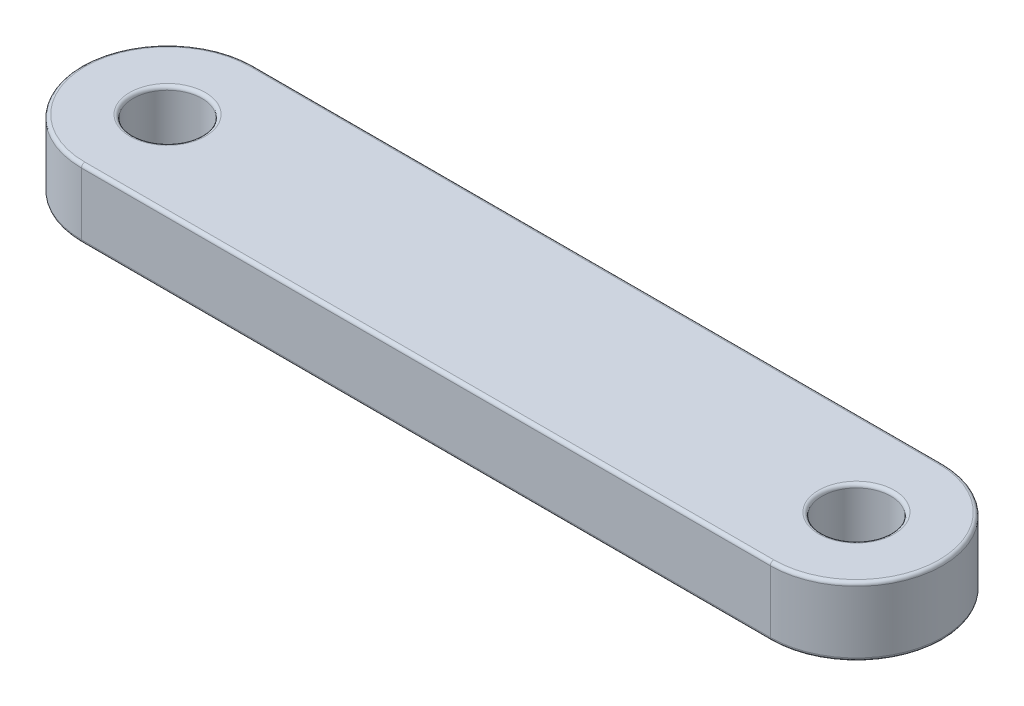
ISO-10303-21;
HEADER;
FILE_DESCRIPTION(('STEP AP214'),'2;1');
FILE_NAME('part.step','',(''),(''),'','','');
FILE_SCHEMA(('AUTOMOTIVE_DESIGN { 1 0 10303 214 1 1 1 1 }'));
ENDSEC;
DATA;
#1=APPLICATION_CONTEXT('core data for automotive mechanical design processes');
#2=APPLICATION_PROTOCOL_DEFINITION('international standard','automotive_design',2000,#1);
#3=PRODUCT_CONTEXT('',#1,'mechanical');
#4=PRODUCT('Part','Part','',(#3));
#5=PRODUCT_RELATED_PRODUCT_CATEGORY('part','',(#4));
#6=PRODUCT_DEFINITION_FORMATION('','',#4);
#7=PRODUCT_DEFINITION_CONTEXT('part definition',#1,'design');
#8=PRODUCT_DEFINITION('design','',#6,#7);
#9=PRODUCT_DEFINITION_SHAPE('','',#8);
#10=(LENGTH_UNIT() NAMED_UNIT(*) SI_UNIT(.MILLI.,.METRE.));
#11=(NAMED_UNIT(*) PLANE_ANGLE_UNIT() SI_UNIT($,.RADIAN.));
#12=(NAMED_UNIT(*) SI_UNIT($,.STERADIAN.) SOLID_ANGLE_UNIT());
#13=UNCERTAINTY_MEASURE_WITH_UNIT(LENGTH_MEASURE(1.E-05),#10,'distance_accuracy_value','');
#14=(GEOMETRIC_REPRESENTATION_CONTEXT(3) GLOBAL_UNCERTAINTY_ASSIGNED_CONTEXT((#13)) GLOBAL_UNIT_ASSIGNED_CONTEXT((#10,
#11,#12)) REPRESENTATION_CONTEXT('',''));
#15=CARTESIAN_POINT('',(0.,0.,0.));
#16=DIRECTION('',(0.,0.,1.));
#17=DIRECTION('',(1.,0.,0.));
#18=AXIS2_PLACEMENT_3D('',#15,#16,#17);
#19=CARTESIAN_POINT('',(-100.,20.,0.));
#20=DIRECTION('',(0.,1.,0.));
#21=DIRECTION('',(0.,0.,1.));
#22=AXIS2_PLACEMENT_3D('',#19,#20,#21);
#23=PLANE('',#22);
#24=CARTESIAN_POINT('',(100.,20.,0.));
#25=DIRECTION('',(0.,1.,0.));
#26=DIRECTION('',(0.,0.,1.));
#27=AXIS2_PLACEMENT_3D('',#24,#25,#26);
#28=CIRCLE('',#27,11.);
#29=CARTESIAN_POINT('',(100.,20.,11.));
#30=VERTEX_POINT('',#29);
#31=EDGE_CURVE('E11',#30,#30,#28,.F.);
#32=ORIENTED_EDGE('',*,*,#31,.T.);
#33=EDGE_LOOP('',(#32));
#34=FACE_BOUND('',#33,.T.);
#35=CARTESIAN_POINT('',(100.,20.,0.));
#36=DIRECTION('',(0.,1.,0.));
#37=DIRECTION('',(0.,0.,1.));
#38=AXIS2_PLACEMENT_3D('',#35,#36,#37);
#39=CIRCLE('',#38,24.);
#40=CARTESIAN_POINT('',(100.,20.,24.));
#41=VERTEX_POINT('',#40);
#42=CARTESIAN_POINT('',(100.,20.,-24.));
#43=VERTEX_POINT('',#42);
#44=EDGE_CURVE('E49',#41,#43,#39,.T.);
#45=ORIENTED_EDGE('',*,*,#44,.T.);
#46=DIRECTION('',(-1.,0.,0.));
#47=VECTOR('',#46,1.);
#48=CARTESIAN_POINT('',(-100.,20.,-24.));
#49=LINE('',#48,#47);
#50=CARTESIAN_POINT('',(-100.,20.,-24.));
#51=VERTEX_POINT('',#50);
#52=EDGE_CURVE('E41',#43,#51,#49,.T.);
#53=ORIENTED_EDGE('',*,*,#52,.T.);
#54=CARTESIAN_POINT('',(-100.,20.,0.));
#55=DIRECTION('',(0.,1.,0.));
#56=DIRECTION('',(0.,0.,1.));
#57=AXIS2_PLACEMENT_3D('',#54,#55,#56);
#58=CIRCLE('',#57,24.);
#59=CARTESIAN_POINT('',(-100.,20.,24.));
#60=VERTEX_POINT('',#59);
#61=EDGE_CURVE('E167',#51,#60,#58,.T.);
#62=ORIENTED_EDGE('',*,*,#61,.T.);
#63=DIRECTION('',(1.,0.,0.));
#64=VECTOR('',#63,1.);
#65=CARTESIAN_POINT('',(100.,20.,24.));
#66=LINE('',#65,#64);
#67=EDGE_CURVE('E54',#60,#41,#66,.T.);
#68=ORIENTED_EDGE('',*,*,#67,.T.);
#69=EDGE_LOOP('',(#45,#53,#62,#68));
#70=FACE_BOUND('',#69,.T.);
#71=CARTESIAN_POINT('',(-100.,20.,0.));
#72=DIRECTION('',(0.,1.,0.));
#73=DIRECTION('',(0.,0.,1.));
#74=AXIS2_PLACEMENT_3D('',#71,#72,#73);
#75=CIRCLE('',#74,11.);
#76=CARTESIAN_POINT('',(-100.,20.,11.));
#77=VERTEX_POINT('',#76);
#78=EDGE_CURVE('E164',#77,#77,#75,.F.);
#79=ORIENTED_EDGE('',*,*,#78,.T.);
#80=EDGE_LOOP('',(#79));
#81=FACE_BOUND('',#80,.T.);
#82=ADVANCED_FACE('F32',(#34,#70,#81),#23,.T.);
#83=CARTESIAN_POINT('',(-100.,0.,0.));
#84=DIRECTION('',(0.,1.,0.));
#85=DIRECTION('',(0.,0.,1.));
#86=AXIS2_PLACEMENT_3D('',#83,#84,#85);
#87=PLANE('',#86);
#88=CARTESIAN_POINT('',(100.,0.,0.));
#89=DIRECTION('',(0.,1.,0.));
#90=DIRECTION('',(0.,0.,1.));
#91=AXIS2_PLACEMENT_3D('',#88,#89,#90);
#92=CIRCLE('',#91,11.);
#93=CARTESIAN_POINT('',(100.,0.,11.));
#94=VERTEX_POINT('',#93);
#95=EDGE_CURVE('E129',#94,#94,#92,.T.);
#96=ORIENTED_EDGE('',*,*,#95,.T.);
#97=EDGE_LOOP('',(#96));
#98=FACE_BOUND('',#97,.T.);
#99=CARTESIAN_POINT('',(-100.,0.,0.));
#100=DIRECTION('',(0.,1.,0.));
#101=DIRECTION('',(0.,0.,1.));
#102=AXIS2_PLACEMENT_3D('',#99,#100,#101);
#103=CIRCLE('',#102,11.);
#104=CARTESIAN_POINT('',(-100.,0.,11.));
#105=VERTEX_POINT('',#104);
#106=EDGE_CURVE('E126',#105,#105,#103,.T.);
#107=ORIENTED_EDGE('',*,*,#106,.T.);
#108=EDGE_LOOP('',(#107));
#109=FACE_BOUND('',#108,.T.);
#110=CARTESIAN_POINT('',(100.,0.,0.));
#111=DIRECTION('',(0.,1.,0.));
#112=DIRECTION('',(0.,0.,1.));
#113=AXIS2_PLACEMENT_3D('',#110,#111,#112);
#114=CIRCLE('',#113,24.);
#115=CARTESIAN_POINT('',(100.,0.,-24.));
#116=VERTEX_POINT('',#115);
#117=CARTESIAN_POINT('',(100.,0.,24.));
#118=VERTEX_POINT('',#117);
#119=EDGE_CURVE('E125',#116,#118,#114,.F.);
#120=ORIENTED_EDGE('',*,*,#119,.T.);
#121=DIRECTION('',(1.,0.,0.));
#122=VECTOR('',#121,1.);
#123=CARTESIAN_POINT('',(-100.,0.,24.));
#124=LINE('',#123,#122);
#125=CARTESIAN_POINT('',(-100.,0.,24.));
#126=VERTEX_POINT('',#125);
#127=EDGE_CURVE('E104',#118,#126,#124,.F.);
#128=ORIENTED_EDGE('',*,*,#127,.T.);
#129=CARTESIAN_POINT('',(-100.,0.,0.));
#130=DIRECTION('',(0.,1.,0.));
#131=DIRECTION('',(0.,0.,1.));
#132=AXIS2_PLACEMENT_3D('',#129,#130,#131);
#133=CIRCLE('',#132,24.);
#134=CARTESIAN_POINT('',(-100.,0.,-24.));
#135=VERTEX_POINT('',#134);
#136=EDGE_CURVE('E114',#126,#135,#133,.F.);
#137=ORIENTED_EDGE('',*,*,#136,.T.);
#138=DIRECTION('',(-1.,0.,0.));
#139=VECTOR('',#138,1.);
#140=CARTESIAN_POINT('',(-100.,0.,-24.));
#141=LINE('',#140,#139);
#142=EDGE_CURVE('E120',#135,#116,#141,.F.);
#143=ORIENTED_EDGE('',*,*,#142,.T.);
#144=EDGE_LOOP('',(#120,#128,#137,#143));
#145=FACE_BOUND('',#144,.T.);
#146=ADVANCED_FACE('F123',(#98,#109,#145),#87,.F.);
#147=CARTESIAN_POINT('',(-100.,20.,0.));
#148=DIRECTION('',(0.,-1.,0.));
#149=DIRECTION('',(0.,0.,-1.));
#150=AXIS2_PLACEMENT_3D('',#147,#148,#149);
#151=CYLINDRICAL_SURFACE('',#150,25.);
#152=DIRECTION('',(0.,-1.,0.));
#153=VECTOR('',#152,1.);
#154=CARTESIAN_POINT('',(-100.,20.,-25.));
#155=LINE('',#154,#153);
#156=CARTESIAN_POINT('',(-100.,19.,-25.));
#157=VERTEX_POINT('',#156);
#158=CARTESIAN_POINT('',(-100.,1.,-25.));
#159=VERTEX_POINT('',#158);
#160=EDGE_CURVE('E176',#157,#159,#155,.T.);
#161=ORIENTED_EDGE('',*,*,#160,.T.);
#162=CARTESIAN_POINT('',(-100.,1.,0.));
#163=DIRECTION('',(0.,1.,0.));
#164=DIRECTION('',(0.,0.,1.));
#165=AXIS2_PLACEMENT_3D('',#162,#163,#164);
#166=CIRCLE('',#165,25.);
#167=CARTESIAN_POINT('',(-100.,1.,25.));
#168=VERTEX_POINT('',#167);
#169=EDGE_CURVE('E162',#159,#168,#166,.T.);
#170=ORIENTED_EDGE('',*,*,#169,.T.);
#171=DIRECTION('',(0.,-1.,0.));
#172=VECTOR('',#171,1.);
#173=CARTESIAN_POINT('',(-100.,20.,25.));
#174=LINE('',#173,#172);
#175=CARTESIAN_POINT('',(-100.,19.,25.));
#176=VERTEX_POINT('',#175);
#177=EDGE_CURVE('E121',#176,#168,#174,.T.);
#178=ORIENTED_EDGE('',*,*,#177,.F.);
#179=CARTESIAN_POINT('',(-100.,19.,0.));
#180=DIRECTION('',(0.,1.,0.));
#181=DIRECTION('',(0.,0.,1.));
#182=AXIS2_PLACEMENT_3D('',#179,#180,#181);
#183=CIRCLE('',#182,25.);
#184=EDGE_CURVE('E160',#176,#157,#183,.F.);
#185=ORIENTED_EDGE('',*,*,#184,.T.);
#186=EDGE_LOOP('',(#161,#170,#178,#185));
#187=FACE_BOUND('',#186,.T.);
#188=ADVANCED_FACE('F202',(#187),#151,.T.);
#189=CARTESIAN_POINT('',(-100.,20.,25.));
#190=DIRECTION('',(0.,0.,-1.));
#191=DIRECTION('',(-1.,0.,0.));
#192=AXIS2_PLACEMENT_3D('',#189,#190,#191);
#193=PLANE('',#192);
#194=ORIENTED_EDGE('',*,*,#177,.T.);
#195=DIRECTION('',(1.,0.,0.));
#196=VECTOR('',#195,1.);
#197=CARTESIAN_POINT('',(-100.,1.,25.));
#198=LINE('',#197,#196);
#199=CARTESIAN_POINT('',(100.,1.,25.));
#200=VERTEX_POINT('',#199);
#201=EDGE_CURVE('E107',#168,#200,#198,.T.);
#202=ORIENTED_EDGE('',*,*,#201,.T.);
#203=DIRECTION('',(0.,-1.,0.));
#204=VECTOR('',#203,1.);
#205=CARTESIAN_POINT('',(100.,20.,25.));
#206=LINE('',#205,#204);
#207=CARTESIAN_POINT('',(100.,19.,25.));
#208=VERTEX_POINT('',#207);
#209=EDGE_CURVE('E199',#208,#200,#206,.T.);
#210=ORIENTED_EDGE('',*,*,#209,.F.);
#211=DIRECTION('',(1.,0.,0.));
#212=VECTOR('',#211,1.);
#213=CARTESIAN_POINT('',(-100.,19.,25.));
#214=LINE('',#213,#212);
#215=EDGE_CURVE('E148',#208,#176,#214,.F.);
#216=ORIENTED_EDGE('',*,*,#215,.T.);
#217=EDGE_LOOP('',(#194,#202,#210,#216));
#218=FACE_BOUND('',#217,.T.);
#219=ADVANCED_FACE('F197',(#218),#193,.F.);
#220=CARTESIAN_POINT('',(100.,20.,0.));
#221=DIRECTION('',(0.,-1.,0.));
#222=DIRECTION('',(0.,0.,-1.));
#223=AXIS2_PLACEMENT_3D('',#220,#221,#222);
#224=CYLINDRICAL_SURFACE('',#223,25.);
#225=ORIENTED_EDGE('',*,*,#209,.T.);
#226=CARTESIAN_POINT('',(100.,1.,0.));
#227=DIRECTION('',(0.,1.,0.));
#228=DIRECTION('',(0.,0.,1.));
#229=AXIS2_PLACEMENT_3D('',#226,#227,#228);
#230=CIRCLE('',#229,25.);
#231=CARTESIAN_POINT('',(100.,1.,-25.));
#232=VERTEX_POINT('',#231);
#233=EDGE_CURVE('E153',#200,#232,#230,.T.);
#234=ORIENTED_EDGE('',*,*,#233,.T.);
#235=DIRECTION('',(0.,-1.,0.));
#236=VECTOR('',#235,1.);
#237=CARTESIAN_POINT('',(100.,20.,-25.));
#238=LINE('',#237,#236);
#239=CARTESIAN_POINT('',(100.,19.,-25.));
#240=VERTEX_POINT('',#239);
#241=EDGE_CURVE('E205',#240,#232,#238,.T.);
#242=ORIENTED_EDGE('',*,*,#241,.F.);
#243=CARTESIAN_POINT('',(100.,19.,0.));
#244=DIRECTION('',(0.,1.,0.));
#245=DIRECTION('',(0.,0.,1.));
#246=AXIS2_PLACEMENT_3D('',#243,#244,#245);
#247=CIRCLE('',#246,25.);
#248=EDGE_CURVE('E151',#240,#208,#247,.F.);
#249=ORIENTED_EDGE('',*,*,#248,.T.);
#250=EDGE_LOOP('',(#225,#234,#242,#249));
#251=FACE_BOUND('',#250,.T.);
#252=ADVANCED_FACE('F218',(#251),#224,.T.);
#253=CARTESIAN_POINT('',(-100.,20.,-25.));
#254=DIRECTION('',(0.,0.,1.));
#255=DIRECTION('',(1.,0.,0.));
#256=AXIS2_PLACEMENT_3D('',#253,#254,#255);
#257=PLANE('',#256);
#258=ORIENTED_EDGE('',*,*,#241,.T.);
#259=DIRECTION('',(-1.,0.,0.));
#260=VECTOR('',#259,1.);
#261=CARTESIAN_POINT('',(-100.,1.,-25.));
#262=LINE('',#261,#260);
#263=EDGE_CURVE('E158',#232,#159,#262,.T.);
#264=ORIENTED_EDGE('',*,*,#263,.T.);
#265=ORIENTED_EDGE('',*,*,#160,.F.);
#266=DIRECTION('',(-1.,0.,0.));
#267=VECTOR('',#266,1.);
#268=CARTESIAN_POINT('',(100.,19.,-25.));
#269=LINE('',#268,#267);
#270=EDGE_CURVE('E155',#157,#240,#269,.F.);
#271=ORIENTED_EDGE('',*,*,#270,.T.);
#272=EDGE_LOOP('',(#258,#264,#265,#271));
#273=FACE_BOUND('',#272,.T.);
#274=ADVANCED_FACE('F222',(#273),#257,.F.);
#275=CARTESIAN_POINT('',(-100.,20.,0.));
#276=DIRECTION('',(0.,-1.,0.));
#277=DIRECTION('',(0.,0.,-1.));
#278=AXIS2_PLACEMENT_3D('',#275,#276,#277);
#279=CYLINDRICAL_SURFACE('',#278,9.99999999999999);
#280=CARTESIAN_POINT('',(-100.,1.,0.));
#281=DIRECTION('',(0.,1.,0.));
#282=DIRECTION('',(0.,0.,1.));
#283=AXIS2_PLACEMENT_3D('',#280,#281,#282);
#284=CIRCLE('',#283,9.99999999999999);
#285=CARTESIAN_POINT('',(-100.,1.,9.99999999999999));
#286=VERTEX_POINT('',#285);
#287=EDGE_CURVE('E145',#286,#286,#284,.F.);
#288=ORIENTED_EDGE('',*,*,#287,.T.);
#289=EDGE_LOOP('',(#288));
#290=FACE_BOUND('',#289,.T.);
#291=CARTESIAN_POINT('',(-100.,19.,0.));
#292=DIRECTION('',(0.,1.,0.));
#293=DIRECTION('',(0.,0.,1.));
#294=AXIS2_PLACEMENT_3D('',#291,#292,#293);
#295=CIRCLE('',#294,9.99999999999999);
#296=CARTESIAN_POINT('',(-100.,19.,9.99999999999999));
#297=VERTEX_POINT('',#296);
#298=EDGE_CURVE('E142',#297,#297,#295,.T.);
#299=ORIENTED_EDGE('',*,*,#298,.T.);
#300=EDGE_LOOP('',(#299));
#301=FACE_BOUND('',#300,.T.);
#302=ADVANCED_FACE('F238',(#290,#301),#279,.F.);
#303=CARTESIAN_POINT('',(100.,20.,0.));
#304=DIRECTION('',(0.,-1.,0.));
#305=DIRECTION('',(0.,0.,-1.));
#306=AXIS2_PLACEMENT_3D('',#303,#304,#305);
#307=CYLINDRICAL_SURFACE('',#306,9.99999999999999);
#308=CARTESIAN_POINT('',(100.,1.,0.));
#309=DIRECTION('',(0.,1.,0.));
#310=DIRECTION('',(0.,0.,1.));
#311=AXIS2_PLACEMENT_3D('',#308,#309,#310);
#312=CIRCLE('',#311,9.99999999999999);
#313=CARTESIAN_POINT('',(100.,1.,9.99999999999999));
#314=VERTEX_POINT('',#313);
#315=EDGE_CURVE('E139',#314,#314,#312,.F.);
#316=ORIENTED_EDGE('',*,*,#315,.T.);
#317=EDGE_LOOP('',(#316));
#318=FACE_BOUND('',#317,.T.);
#319=CARTESIAN_POINT('',(100.,19.,0.));
#320=DIRECTION('',(0.,1.,0.));
#321=DIRECTION('',(0.,0.,1.));
#322=AXIS2_PLACEMENT_3D('',#319,#320,#321);
#323=CIRCLE('',#322,9.99999999999999);
#324=CARTESIAN_POINT('',(100.,19.,9.99999999999999));
#325=VERTEX_POINT('',#324);
#326=EDGE_CURVE('E136',#325,#325,#323,.T.);
#327=ORIENTED_EDGE('',*,*,#326,.T.);
#328=EDGE_LOOP('',(#327));
#329=FACE_BOUND('',#328,.T.);
#330=ADVANCED_FACE('F240',(#318,#329),#307,.F.);
#331=CARTESIAN_POINT('',(100.,1.,0.));
#332=DIRECTION('',(0.,1.,0.));
#333=DIRECTION('',(0.,0.,1.));
#334=AXIS2_PLACEMENT_3D('',#331,#332,#333);
#335=TOROIDAL_SURFACE('',#334,11.,1.);
#336=ORIENTED_EDGE('',*,*,#315,.F.);
#337=EDGE_LOOP('',(#336));
#338=FACE_BOUND('',#337,.T.);
#339=ORIENTED_EDGE('',*,*,#95,.F.);
#340=EDGE_LOOP('',(#339));
#341=FACE_BOUND('',#340,.T.);
#342=ADVANCED_FACE('F247',(#338,#341),#335,.T.);
#343=CARTESIAN_POINT('',(-100.,1.,0.));
#344=DIRECTION('',(0.,1.,0.));
#345=DIRECTION('',(0.,0.,1.));
#346=AXIS2_PLACEMENT_3D('',#343,#344,#345);
#347=TOROIDAL_SURFACE('',#346,11.,1.);
#348=ORIENTED_EDGE('',*,*,#287,.F.);
#349=EDGE_LOOP('',(#348));
#350=FACE_BOUND('',#349,.T.);
#351=ORIENTED_EDGE('',*,*,#106,.F.);
#352=EDGE_LOOP('',(#351));
#353=FACE_BOUND('',#352,.T.);
#354=ADVANCED_FACE('F263',(#350,#353),#347,.T.);
#355=CARTESIAN_POINT('',(-100.,1.,-24.));
#356=DIRECTION('',(-1.,0.,0.));
#357=DIRECTION('',(0.,0.,1.));
#358=AXIS2_PLACEMENT_3D('',#355,#356,#357);
#359=CYLINDRICAL_SURFACE('',#358,1.);
#360=CARTESIAN_POINT('',(100.,1.,-24.));
#361=DIRECTION('',(1.,0.,0.));
#362=DIRECTION('',(0.,0.,-1.));
#363=AXIS2_PLACEMENT_3D('',#360,#361,#362);
#364=CIRCLE('',#363,1.);
#365=EDGE_CURVE('E110',#116,#232,#364,.T.);
#366=ORIENTED_EDGE('',*,*,#365,.F.);
#367=ORIENTED_EDGE('',*,*,#142,.F.);
#368=CARTESIAN_POINT('',(-100.,1.,-24.));
#369=DIRECTION('',(-1.,0.,0.));
#370=DIRECTION('',(0.,0.,1.));
#371=AXIS2_PLACEMENT_3D('',#368,#369,#370);
#372=CIRCLE('',#371,1.);
#373=EDGE_CURVE('E117',#159,#135,#372,.T.);
#374=ORIENTED_EDGE('',*,*,#373,.F.);
#375=ORIENTED_EDGE('',*,*,#263,.F.);
#376=EDGE_LOOP('',(#366,#367,#374,#375));
#377=FACE_BOUND('',#376,.T.);
#378=ADVANCED_FACE('F211',(#377),#359,.T.);
#379=CARTESIAN_POINT('',(-100.,1.,0.));
#380=DIRECTION('',(0.,1.,0.));
#381=DIRECTION('',(0.,0.,1.));
#382=AXIS2_PLACEMENT_3D('',#379,#380,#381);
#383=TOROIDAL_SURFACE('',#382,24.,1.);
#384=ORIENTED_EDGE('',*,*,#373,.T.);
#385=ORIENTED_EDGE('',*,*,#136,.F.);
#386=CARTESIAN_POINT('',(-100.,1.,24.));
#387=DIRECTION('',(1.,0.,0.));
#388=DIRECTION('',(0.,0.,-1.));
#389=AXIS2_PLACEMENT_3D('',#386,#387,#388);
#390=CIRCLE('',#389,1.);
#391=EDGE_CURVE('E100',#168,#126,#390,.T.);
#392=ORIENTED_EDGE('',*,*,#391,.F.);
#393=ORIENTED_EDGE('',*,*,#169,.F.);
#394=EDGE_LOOP('',(#384,#385,#392,#393));
#395=FACE_BOUND('',#394,.T.);
#396=ADVANCED_FACE('F115',(#395),#383,.T.);
#397=CARTESIAN_POINT('',(100.,1.,0.));
#398=DIRECTION('',(0.,1.,0.));
#399=DIRECTION('',(0.,0.,1.));
#400=AXIS2_PLACEMENT_3D('',#397,#398,#399);
#401=TOROIDAL_SURFACE('',#400,24.,1.);
#402=ORIENTED_EDGE('',*,*,#365,.T.);
#403=ORIENTED_EDGE('',*,*,#233,.F.);
#404=CARTESIAN_POINT('',(100.,1.,24.));
#405=DIRECTION('',(-1.,0.,0.));
#406=DIRECTION('',(0.,0.,1.));
#407=AXIS2_PLACEMENT_3D('',#404,#405,#406);
#408=CIRCLE('',#407,1.);
#409=EDGE_CURVE('E111',#118,#200,#408,.T.);
#410=ORIENTED_EDGE('',*,*,#409,.F.);
#411=ORIENTED_EDGE('',*,*,#119,.F.);
#412=EDGE_LOOP('',(#402,#403,#410,#411));
#413=FACE_BOUND('',#412,.T.);
#414=ADVANCED_FACE('F214',(#413),#401,.T.);
#415=CARTESIAN_POINT('',(-100.,1.,24.));
#416=DIRECTION('',(1.,0.,0.));
#417=DIRECTION('',(0.,0.,-1.));
#418=AXIS2_PLACEMENT_3D('',#415,#416,#417);
#419=CYLINDRICAL_SURFACE('',#418,1.);
#420=ORIENTED_EDGE('',*,*,#391,.T.);
#421=ORIENTED_EDGE('',*,*,#127,.F.);
#422=ORIENTED_EDGE('',*,*,#409,.T.);
#423=ORIENTED_EDGE('',*,*,#201,.F.);
#424=EDGE_LOOP('',(#420,#421,#422,#423));
#425=FACE_BOUND('',#424,.T.);
#426=ADVANCED_FACE('F102',(#425),#419,.T.);
#427=CARTESIAN_POINT('',(100.,19.,0.));
#428=DIRECTION('',(0.,1.,0.));
#429=DIRECTION('',(0.,0.,1.));
#430=AXIS2_PLACEMENT_3D('',#427,#428,#429);
#431=TOROIDAL_SURFACE('',#430,11.,1.);
#432=ORIENTED_EDGE('',*,*,#31,.F.);
#433=EDGE_LOOP('',(#432));
#434=FACE_BOUND('',#433,.T.);
#435=ORIENTED_EDGE('',*,*,#326,.F.);
#436=EDGE_LOOP('',(#435));
#437=FACE_BOUND('',#436,.T.);
#438=ADVANCED_FACE('F270',(#434,#437),#431,.T.);
#439=CARTESIAN_POINT('',(-100.,19.,24.));
#440=DIRECTION('',(-1.,0.,0.));
#441=DIRECTION('',(0.,0.,1.));
#442=AXIS2_PLACEMENT_3D('',#439,#440,#441);
#443=CYLINDRICAL_SURFACE('',#442,1.);
#444=CARTESIAN_POINT('',(-100.,19.,24.));
#445=DIRECTION('',(-1.,0.,0.));
#446=DIRECTION('',(0.,0.,1.));
#447=AXIS2_PLACEMENT_3D('',#444,#445,#446);
#448=CIRCLE('',#447,1.);
#449=EDGE_CURVE('E180',#176,#60,#448,.T.);
#450=ORIENTED_EDGE('',*,*,#449,.F.);
#451=ORIENTED_EDGE('',*,*,#215,.F.);
#452=CARTESIAN_POINT('',(100.,19.,24.));
#453=DIRECTION('',(1.,0.,0.));
#454=DIRECTION('',(0.,0.,-1.));
#455=AXIS2_PLACEMENT_3D('',#452,#453,#454);
#456=CIRCLE('',#455,1.);
#457=EDGE_CURVE('E36',#41,#208,#456,.T.);
#458=ORIENTED_EDGE('',*,*,#457,.F.);
#459=ORIENTED_EDGE('',*,*,#67,.F.);
#460=EDGE_LOOP('',(#450,#451,#458,#459));
#461=FACE_BOUND('',#460,.T.);
#462=ADVANCED_FACE('F192',(#461),#443,.T.);
#463=CARTESIAN_POINT('',(100.,19.,0.));
#464=DIRECTION('',(0.,1.,0.));
#465=DIRECTION('',(0.,0.,1.));
#466=AXIS2_PLACEMENT_3D('',#463,#464,#465);
#467=TOROIDAL_SURFACE('',#466,24.,1.);
#468=ORIENTED_EDGE('',*,*,#457,.T.);
#469=ORIENTED_EDGE('',*,*,#248,.F.);
#470=CARTESIAN_POINT('',(100.,19.,-24.));
#471=DIRECTION('',(-1.,0.,0.));
#472=DIRECTION('',(0.,0.,1.));
#473=AXIS2_PLACEMENT_3D('',#470,#471,#472);
#474=CIRCLE('',#473,1.);
#475=EDGE_CURVE('E179',#43,#240,#474,.T.);
#476=ORIENTED_EDGE('',*,*,#475,.F.);
#477=ORIENTED_EDGE('',*,*,#44,.F.);
#478=EDGE_LOOP('',(#468,#469,#476,#477));
#479=FACE_BOUND('',#478,.T.);
#480=ADVANCED_FACE('F189',(#479),#467,.T.);
#481=CARTESIAN_POINT('',(-100.,19.,0.));
#482=DIRECTION('',(0.,1.,0.));
#483=DIRECTION('',(0.,0.,1.));
#484=AXIS2_PLACEMENT_3D('',#481,#482,#483);
#485=TOROIDAL_SURFACE('',#484,24.,1.);
#486=ORIENTED_EDGE('',*,*,#449,.T.);
#487=ORIENTED_EDGE('',*,*,#61,.F.);
#488=CARTESIAN_POINT('',(-100.,19.,-24.));
#489=DIRECTION('',(1.,0.,0.));
#490=DIRECTION('',(0.,0.,-1.));
#491=AXIS2_PLACEMENT_3D('',#488,#489,#490);
#492=CIRCLE('',#491,1.);
#493=EDGE_CURVE('E177',#157,#51,#492,.T.);
#494=ORIENTED_EDGE('',*,*,#493,.F.);
#495=ORIENTED_EDGE('',*,*,#184,.F.);
#496=EDGE_LOOP('',(#486,#487,#494,#495));
#497=FACE_BOUND('',#496,.T.);
#498=ADVANCED_FACE('F227',(#497),#485,.T.);
#499=CARTESIAN_POINT('',(-100.,19.,-24.));
#500=DIRECTION('',(1.,0.,0.));
#501=DIRECTION('',(0.,0.,-1.));
#502=AXIS2_PLACEMENT_3D('',#499,#500,#501);
#503=CYLINDRICAL_SURFACE('',#502,1.);
#504=ORIENTED_EDGE('',*,*,#475,.T.);
#505=ORIENTED_EDGE('',*,*,#270,.F.);
#506=ORIENTED_EDGE('',*,*,#493,.T.);
#507=ORIENTED_EDGE('',*,*,#52,.F.);
#508=EDGE_LOOP('',(#504,#505,#506,#507));
#509=FACE_BOUND('',#508,.T.);
#510=ADVANCED_FACE('F225',(#509),#503,.T.);
#511=CARTESIAN_POINT('',(-100.,19.,0.));
#512=DIRECTION('',(0.,1.,0.));
#513=DIRECTION('',(0.,0.,1.));
#514=AXIS2_PLACEMENT_3D('',#511,#512,#513);
#515=TOROIDAL_SURFACE('',#514,11.,1.);
#516=ORIENTED_EDGE('',*,*,#78,.F.);
#517=EDGE_LOOP('',(#516));
#518=FACE_BOUND('',#517,.T.);
#519=ORIENTED_EDGE('',*,*,#298,.F.);
#520=EDGE_LOOP('',(#519));
#521=FACE_BOUND('',#520,.T.);
#522=ADVANCED_FACE('F34',(#518,#521),#515,.T.);
#523=CLOSED_SHELL('',(#82,#146,#188,#219,#252,#274,#302,#330,#342,#354,#378,#396,#414,#426,#438,
#462,#480,#498,#510,#522));
#524=MANIFOLD_SOLID_BREP('B2',#523);
#525=ADVANCED_BREP_SHAPE_REPRESENTATION('',(#18,#524),#14);
#526=SHAPE_DEFINITION_REPRESENTATION(#9,#525);
ENDSEC;
END-ISO-10303-21;
